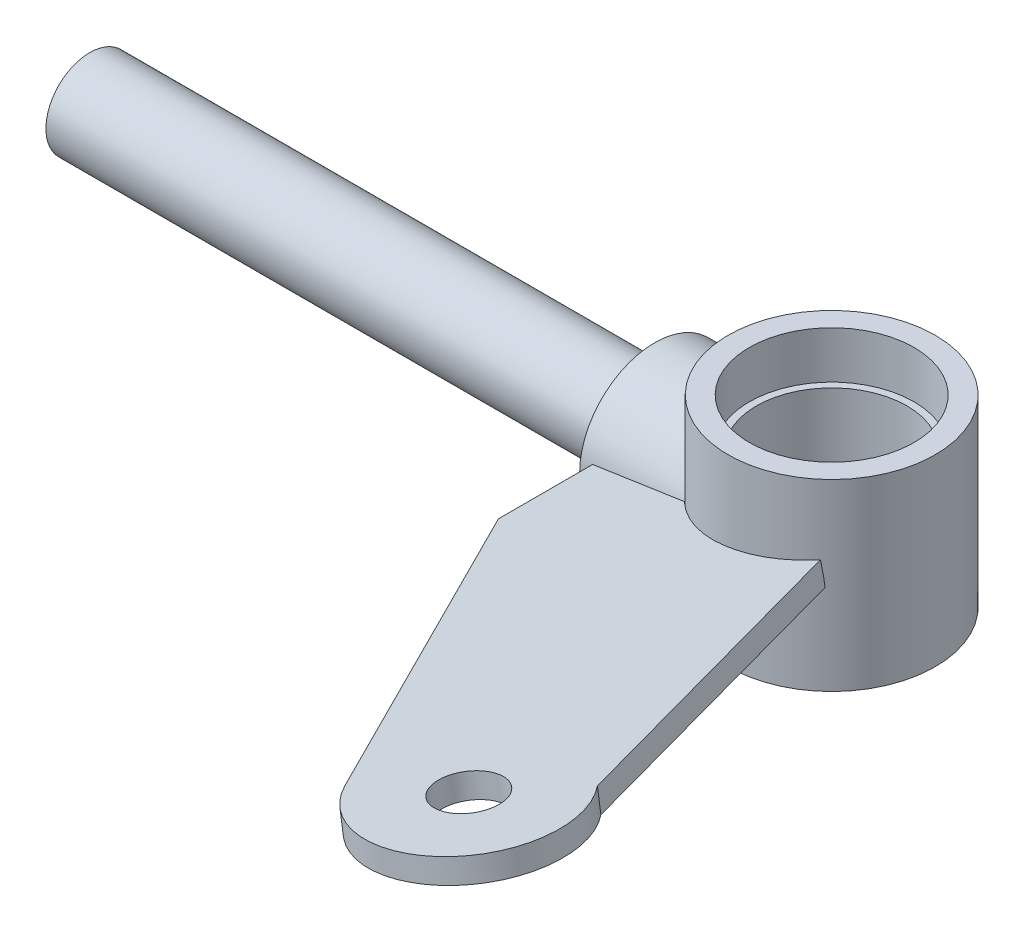
ISO-10303-21;
HEADER;
FILE_DESCRIPTION(('STEP AP214'),'2;1');
FILE_NAME('part.step','',(''),(''),'','','');
FILE_SCHEMA(('AUTOMOTIVE_DESIGN { 1 0 10303 214 1 1 1 1 }'));
ENDSEC;
DATA;
#1=APPLICATION_CONTEXT('core data for automotive mechanical design processes');
#2=APPLICATION_PROTOCOL_DEFINITION('international standard','automotive_design',2000,#1);
#3=PRODUCT_CONTEXT('',#1,'mechanical');
#4=PRODUCT('Part','Part','',(#3));
#5=PRODUCT_RELATED_PRODUCT_CATEGORY('part','',(#4));
#6=PRODUCT_DEFINITION_FORMATION('','',#4);
#7=PRODUCT_DEFINITION_CONTEXT('part definition',#1,'design');
#8=PRODUCT_DEFINITION('design','',#6,#7);
#9=PRODUCT_DEFINITION_SHAPE('','',#8);
#10=(LENGTH_UNIT() NAMED_UNIT(*) SI_UNIT(.MILLI.,.METRE.));
#11=(NAMED_UNIT(*) PLANE_ANGLE_UNIT() SI_UNIT($,.RADIAN.));
#12=(NAMED_UNIT(*) SI_UNIT($,.STERADIAN.) SOLID_ANGLE_UNIT());
#13=UNCERTAINTY_MEASURE_WITH_UNIT(LENGTH_MEASURE(1.E-05),#10,'distance_accuracy_value','');
#14=(GEOMETRIC_REPRESENTATION_CONTEXT(3) GLOBAL_UNCERTAINTY_ASSIGNED_CONTEXT((#13)) GLOBAL_UNIT_ASSIGNED_CONTEXT((#10,
#11,#12)) REPRESENTATION_CONTEXT('',''));
#15=CARTESIAN_POINT('',(0.,0.,0.));
#16=DIRECTION('',(0.,0.,1.));
#17=DIRECTION('',(1.,0.,0.));
#18=AXIS2_PLACEMENT_3D('',#15,#16,#17);
#19=CARTESIAN_POINT('',(-23.8649527829231,-3.56664109055751,0.));
#20=DIRECTION('',(1.,0.,0.));
#21=DIRECTION('',(0.,0.,-1.));
#22=AXIS2_PLACEMENT_3D('',#19,#20,#21);
#23=CYLINDRICAL_SURFACE('',#22,10.1308937353786);
#24=CARTESIAN_POINT('',(-23.8649527829231,-3.56664109055751,0.));
#25=DIRECTION('',(-1.,0.,0.));
#26=DIRECTION('',(0.,0.,1.));
#27=AXIS2_PLACEMENT_3D('',#24,#25,#26);
#28=CIRCLE('',#27,10.1308937353786);
#29=CARTESIAN_POINT('',(-23.8649527829231,-3.56664109055751,10.1308937353786));
#30=VERTEX_POINT('',#29);
#31=EDGE_CURVE('E58',#30,#30,#28,.T.);
#32=ORIENTED_EDGE('',*,*,#31,.F.);
#33=EDGE_LOOP('',(#32));
#34=FACE_BOUND('',#33,.T.);
#35=CARTESIAN_POINT('',(-9.61903800400362,-3.56664109055751,10.1308937353786));
#36=CARTESIAN_POINT('',(-9.61904039518556,-3.80639849007304,10.1308925484275));
#37=CARTESIAN_POINT('',(-9.62804826640795,-4.04617130452357,10.1223617673847));
#38=CARTESIAN_POINT('',(-9.66356299897845,-4.52332005065299,10.088460451511));
#39=CARTESIAN_POINT('',(-9.69007987684676,-4.76069453133077,10.0630802774652));
#40=CARTESIAN_POINT('',(-9.75923055949351,-5.23127763039902,9.99603045747903));
#41=CARTESIAN_POINT('',(-9.8019015506235,-5.46447532682341,9.95432321945606));
#42=CARTESIAN_POINT('',(-9.90128180737341,-5.92461065115534,9.85547651706718));
#43=CARTESIAN_POINT('',(-9.95799916585496,-6.15154458610549,9.79832815451211));
#44=CARTESIAN_POINT('',(-10.0822680357526,-6.59500296099345,9.67039785709462));
#45=CARTESIAN_POINT('',(-10.1496678308784,-6.81162484133087,9.59980439757005));
#46=CARTESIAN_POINT('',(-10.2935220507789,-7.23689009378552,9.44539414340223));
#47=CARTESIAN_POINT('',(-10.3699756105002,-7.4455342256309,9.36157861182483));
#48=CARTESIAN_POINT('',(-10.6096718629706,-8.05899105580503,9.09139352136984));
#49=CARTESIAN_POINT('',(-10.7833486402566,-8.45165774662793,8.8861885255637));
#50=CARTESIAN_POINT('',(-11.0707297974541,-9.05057278524142,8.52232525593784));
#51=CARTESIAN_POINT('',(-11.1803271124111,-9.26806242968694,8.37833864467592));
#52=CARTESIAN_POINT('',(-11.4016441573872,-9.6906947076907,8.07456910940664));
#53=CARTESIAN_POINT('',(-11.5133640558991,-9.89583635561965,7.91478492710445));
#54=CARTESIAN_POINT('',(-11.7367057479711,-10.2935623005356,7.5796609888092));
#55=CARTESIAN_POINT('',(-11.8483272309982,-10.4861301228153,7.40430150800249));
#56=CARTESIAN_POINT('',(-12.0692087650288,-10.8578860164378,7.03851926498492));
#57=CARTESIAN_POINT('',(-12.1784686367169,-11.0370730743084,6.84809536402509));
#58=CARTESIAN_POINT('',(-12.4124255960368,-11.4131649892626,6.41588768798282));
#59=CARTESIAN_POINT('',(-12.5362378994176,-11.6072125319033,6.17112054980703));
#60=CARTESIAN_POINT('',(-12.7744549755405,-11.9737930574009,5.6615641072247));
#61=CARTESIAN_POINT('',(-12.8888578281117,-12.1463216526137,5.39677073715651));
#62=CARTESIAN_POINT('',(-13.1048393114109,-12.4674846211503,4.84877997013028));
#63=CARTESIAN_POINT('',(-13.2064401679256,-12.6161605317473,4.5656157993196));
#64=CARTESIAN_POINT('',(-13.3939004205756,-12.8876020711898,3.98221905452536));
#65=CARTESIAN_POINT('',(-13.4797673764695,-13.0103801476271,3.68199476884057));
#66=CARTESIAN_POINT('',(-13.6110115594488,-13.1966336019867,3.15477503796826));
#67=CARTESIAN_POINT('',(-13.6609505125659,-13.2670334245227,2.93133323530667));
#68=CARTESIAN_POINT('',(-13.7503758553478,-13.392570600585,2.47817568608819));
#69=CARTESIAN_POINT('',(-13.7898645953643,-13.4477113861407,2.24846136312407));
#70=CARTESIAN_POINT('',(-13.8575683254481,-13.5419798008082,1.78428620306748));
#71=CARTESIAN_POINT('',(-13.885790634778,-13.581117826552,1.54982855186427));
#72=CARTESIAN_POINT('',(-13.9303943769411,-13.6428731553088,1.0776134348273));
#73=CARTESIAN_POINT('',(-13.9467753963032,-13.6654898814359,0.83985585406291));
#74=CARTESIAN_POINT('',(-13.9673520552707,-13.6938878916493,0.362262652436662));
#75=CARTESIAN_POINT('',(-13.9715198427555,-13.6996306950487,0.122423530875538));
#76=CARTESIAN_POINT('',(-13.9674958248509,-13.6940815897164,-0.356951834590658));
#77=CARTESIAN_POINT('',(-13.9593040668533,-13.682789746303,-0.596488079653567));
#78=CARTESIAN_POINT('',(-13.9307443343899,-13.6433434302408,-1.0734820401737));
#79=CARTESIAN_POINT('',(-13.9103736947184,-13.6151852665927,-1.31093928912264));
#80=CARTESIAN_POINT('',(-13.8579058877799,-13.5424266781346,-1.78199605263438));
#81=CARTESIAN_POINT('',(-13.8258087529768,-13.4978262988436,-2.01559557787515));
#82=CARTESIAN_POINT('',(-13.7516546264907,-13.3943252629383,-2.47073456285516));
#83=CARTESIAN_POINT('',(-13.7099106900111,-13.3358728600535,-2.69242764401209));
#84=CARTESIAN_POINT('',(-13.6167803089116,-13.2047397005971,-3.12956162592222));
#85=CARTESIAN_POINT('',(-13.5653904956596,-13.132053972933,-3.34500031200948));
#86=CARTESIAN_POINT('',(-13.4539013909604,-12.9732751607129,-3.76847042647945));
#87=CARTESIAN_POINT('',(-13.3938044220822,-12.8871856510606,-3.97650381179523));
#88=CARTESIAN_POINT('',(-13.2658556463471,-12.702366642786,-4.38448447000792));
#89=CARTESIAN_POINT('',(-13.1980010299463,-12.6036325631847,-4.58442877760948));
#90=CARTESIAN_POINT('',(-13.0477251760939,-12.3827907472346,-4.99711503805583));
#91=CARTESIAN_POINT('',(-12.9645227706009,-12.2593060849262,-5.20883565069022));
#92=CARTESIAN_POINT('',(-12.7912655651893,-11.9987261472283,-5.62089044097815));
#93=CARTESIAN_POINT('',(-12.7012078641698,-11.861625101942,-5.82121973456842));
#94=CARTESIAN_POINT('',(-12.5156831813874,-11.5746637198013,-6.21007304769013));
#95=CARTESIAN_POINT('',(-12.4202129330681,-11.4247956498306,-6.39858979053965));
#96=CARTESIAN_POINT('',(-12.2254037176577,-11.1131238721971,-6.76336978651223));
#97=CARTESIAN_POINT('',(-12.1260643094612,-10.9513188017592,-6.93963163609262));
#98=CARTESIAN_POINT('',(-11.9060924564752,-10.5847977195688,-7.31169885898195));
#99=CARTESIAN_POINT('',(-11.784977050915,-10.3777434401458,-7.50492223431334));
#100=CARTESIAN_POINT('',(-11.5421499086569,-9.94838845974052,-7.87326842070626));
#101=CARTESIAN_POINT('',(-11.4204380574974,-9.72608471665142,-8.04838760260167));
#102=CARTESIAN_POINT('',(-11.1793564225601,-9.26667224415712,-8.38002952893089));
#103=CARTESIAN_POINT('',(-11.059987157159,-9.02956028541537,-8.53654819525791));
#104=CARTESIAN_POINT('',(-10.8270403738253,-8.54107815226735,-8.83013329096768));
#105=CARTESIAN_POINT('',(-10.7134613267578,-8.28971177973054,-8.96720487334647));
#106=CARTESIAN_POINT('',(-10.4345578564576,-7.62721997990816,-9.29241023498748));
#107=CARTESIAN_POINT('',(-10.276013055899,-7.20568192841436,-9.46596501358648));
#108=CARTESIAN_POINT('',(-10.0690586595743,-6.55040855821285,-9.68427081004709));
#109=CARTESIAN_POINT('',(-10.0052475501124,-6.32830056588317,-9.7500073736609));
#110=CARTESIAN_POINT('',(-9.89019913814885,-5.87698619457917,-9.86668962366791));
#111=CARTESIAN_POINT('',(-9.83895932371261,-5.64778124400931,-9.91763826528416));
#112=CARTESIAN_POINT('',(-9.75837597016585,-5.22091458018934,-9.99688268890805));
#113=CARTESIAN_POINT('',(-9.72683786447325,-5.0240958262901,-10.0275019956832));
#114=CARTESIAN_POINT('',(-9.67536667327016,-4.62751365762141,-10.077175547512));
#115=CARTESIAN_POINT('',(-9.65543122849678,-4.42775084996649,-10.0962321437387));
#116=CARTESIAN_POINT('',(-9.62795797837324,-4.02671672226621,-10.1224349906279));
#117=CARTESIAN_POINT('',(-9.6204122799653,-3.82544644474953,-10.1295888241474));
#118=CARTESIAN_POINT('',(-9.61800696449502,-3.42275529878834,-10.1318727471276));
#119=CARTESIAN_POINT('',(-9.62314764588194,-3.2213344269125,-10.1270025537211));
#120=CARTESIAN_POINT('',(-9.64588409227045,-2.82015303979755,-10.1053481719863));
#121=CARTESIAN_POINT('',(-9.66346131474361,-2.62039050009428,-10.0885817205352));
#122=CARTESIAN_POINT('',(-9.7103475014837,-2.22359057700764,-10.0434606985891));
#123=CARTESIAN_POINT('',(-9.73965643283577,-2.02655318598011,-10.0151061606061));
#124=CARTESIAN_POINT('',(-9.80896813642319,-1.6361160617716,-9.94723031172033));
#125=CARTESIAN_POINT('',(-9.84898244301011,-1.44272049442085,-9.90769695372883));
#126=CARTESIAN_POINT('',(-9.93840382129691,-1.06054152358299,-9.81799555196965));
#127=CARTESIAN_POINT('',(-9.987816225101,-0.871760807328803,-9.76782146921264));
#128=CARTESIAN_POINT('',(-10.116329852951,-0.423853421042503,-9.63495869026011));
#129=CARTESIAN_POINT('',(-10.1993379012841,-0.167299199204759,-9.54734104960247));
#130=CARTESIAN_POINT('',(-10.3772942193556,0.334306117510249,-9.35360629636579));
#131=CARTESIAN_POINT('',(-10.4722424118898,0.5793572867514,-9.24748930340058));
#132=CARTESIAN_POINT('',(-10.6707826742691,1.05799001089977,-9.01767125631354));
#133=CARTESIAN_POINT('',(-10.7743900143872,1.2915500983756,-8.89393885548554));
#134=CARTESIAN_POINT('',(-10.9870097338924,1.74644839226086,-8.6299043590512));
#135=CARTESIAN_POINT('',(-11.0960215550136,1.96778785605096,-8.48960397280577));
#136=CARTESIAN_POINT('',(-11.3200061370829,2.40435294955986,-8.18868526639421));
#137=CARTESIAN_POINT('',(-11.4350599663479,2.61920935204989,-8.02759203023276));
#138=CARTESIAN_POINT('',(-11.6654520160729,3.03539669583716,-7.68895804136308));
#139=CARTESIAN_POINT('',(-11.7807902494431,3.23672701096218,-7.51141652810762));
#140=CARTESIAN_POINT('',(-12.0092582989231,3.62509143227999,-7.14044990952776));
#141=CARTESIAN_POINT('',(-12.1223902014477,3.81213958654222,-6.9470408106314));
#142=CARTESIAN_POINT('',(-12.3443764724911,4.17142654750338,-6.54447239318099));
#143=CARTESIAN_POINT('',(-12.4532294070762,4.34366041234396,-6.33530786212548));
#144=CARTESIAN_POINT('',(-12.6592105315339,4.66403356177297,-5.91251250663103));
#145=CARTESIAN_POINT('',(-12.756652573291,4.81294498034245,-5.69962055304822));
#146=CARTESIAN_POINT('',(-12.9438341974239,5.09523556233258,-5.26069786253675));
#147=CARTESIAN_POINT('',(-13.0335775948145,5.2286224306741,-5.03467372741163));
#148=CARTESIAN_POINT('',(-13.203639574756,5.47872307569743,-4.5701185779084));
#149=CARTESIAN_POINT('',(-13.2839569590916,5.59543473306986,-4.33158597904411));
#150=CARTESIAN_POINT('',(-13.4334147586671,5.81081876001885,-3.84310964191962));
#151=CARTESIAN_POINT('',(-13.5025552563403,5.90949126264096,-3.59316598783722));
#152=CARTESIAN_POINT('',(-13.6285500984672,6.0881781687157,-3.08116744840382));
#153=CARTESIAN_POINT('',(-13.685296248588,6.16802871246312,-2.8190283988032));
#154=CARTESIAN_POINT('',(-13.7842662640073,6.30667972615402,-2.28653086208386));
#155=CARTESIAN_POINT('',(-13.8264899456796,6.36547992993113,-2.01617227108185));
#156=CARTESIAN_POINT('',(-13.8951876887182,6.46089325607901,-1.46982675384622));
#157=CARTESIAN_POINT('',(-13.92167543574,6.49752565846372,-1.19384493490776));
#158=CARTESIAN_POINT('',(-13.9581604686139,6.54793547020552,-0.638735201978681));
#159=CARTESIAN_POINT('',(-13.9681603176359,6.56171643199589,-0.359607783789694));
#160=CARTESIAN_POINT('',(-13.9711500360893,6.56583795252878,0.159413192084087));
#161=CARTESIAN_POINT('',(-13.9663437645275,6.55921549763676,0.399277514995647));
#162=CARTESIAN_POINT('',(-13.9444750988441,6.52903147048661,0.877354922388121));
#163=CARTESIAN_POINT('',(-13.9274140752457,6.50547179242046,1.11556818850916));
#164=CARTESIAN_POINT('',(-13.8814170008217,6.44177184925209,1.58859789337555));
#165=CARTESIAN_POINT('',(-13.8524806813183,6.40163120900632,1.82341425514167));
#166=CARTESIAN_POINT('',(-13.7833558826398,6.30534603610142,2.28804988925621));
#167=CARTESIAN_POINT('',(-13.7431670481229,6.24920099804036,2.51786900355014));
#168=CARTESIAN_POINT('',(-13.653222476376,6.12286458200034,2.96678777092026));
#169=CARTESIAN_POINT('',(-13.6036632807597,6.05296073537101,3.18600817588901));
#170=CARTESIAN_POINT('',(-13.4953977759985,5.89923694826681,3.61726235028896));
#171=CARTESIAN_POINT('',(-13.4366882895127,5.81541217323288,3.82929359210396));
#172=CARTESIAN_POINT('',(-13.3111546937625,5.63472663802529,4.24514110928424));
#173=CARTESIAN_POINT('',(-13.2443330727005,5.53786987411879,4.44895987820896));
#174=CARTESIAN_POINT('',(-13.1035931875214,5.33189351278721,4.84783428956793));
#175=CARTESIAN_POINT('',(-13.0296723876691,5.22276953127871,5.0428867640026));
#176=CARTESIAN_POINT('',(-12.8655887953336,4.97776246672566,5.44900506020993));
#177=CARTESIAN_POINT('',(-12.774573934779,4.84025107136051,5.65874481038786));
#178=CARTESIAN_POINT('',(-12.5864152819499,4.55148431377991,6.06575202179333));
#179=CARTESIAN_POINT('',(-12.4892688484989,4.40022301627013,6.26301403396537));
#180=CARTESIAN_POINT('',(-12.2903857682433,4.08468018068767,6.64482533350065));
#181=CARTESIAN_POINT('',(-12.1886436622751,3.92038297231731,6.82935880653214));
#182=CARTESIAN_POINT('',(-11.9823876861637,3.57969358465794,7.18509243328137));
#183=CARTESIAN_POINT('',(-11.8778745980929,3.40330479623322,7.35629629651572));
#184=CARTESIAN_POINT('',(-11.647935575154,3.00449779613303,7.71623517005945));
#185=CARTESIAN_POINT('',(-11.5222871992665,2.77967722820198,7.90217618090308));
#186=CARTESIAN_POINT('',(-11.2726129564929,2.31421952225714,8.25443630149153));
#187=CARTESIAN_POINT('',(-11.1485875112876,2.07357836777106,8.42075039824053));
#188=CARTESIAN_POINT('',(-10.9057722570196,1.57697996999549,8.73293186636326));
#189=CARTESIAN_POINT('',(-10.7869801360365,1.32102961008681,8.87880832982476));
#190=CARTESIAN_POINT('',(-10.5587418575411,0.794270740970725,9.14905212486612));
#191=CARTESIAN_POINT('',(-10.4492914539145,0.523469075096433,9.27342925523371));
#192=CARTESIAN_POINT('',(-10.2020195511406,-0.147807927528755,9.54599963851673));
#193=CARTESIAN_POINT('',(-10.0711059209067,-0.555714314304154,9.68286968729264));
#194=CARTESIAN_POINT('',(-9.90733587456377,-1.18537456282063,9.84945002462021));
#195=CARTESIAN_POINT('',(-9.85821569931913,-1.39798272775063,9.89848970747908));
#196=CARTESIAN_POINT('',(-9.77257407853592,-1.82833914504426,9.98305180029197));
#197=CARTESIAN_POINT('',(-9.73604673290652,-2.04608493905188,10.0185805413043));
#198=CARTESIAN_POINT('',(-9.67788393172438,-2.48006028989114,10.0747739941289));
#199=CARTESIAN_POINT('',(-9.65591215394802,-2.69620084434266,10.0957749346338));
#200=CARTESIAN_POINT('',(-9.62648626113937,-3.13043672258906,10.1238371131521));
#201=CARTESIAN_POINT('',(-9.61903582873288,-3.34853252815357,10.1308948151543));
#202=CARTESIAN_POINT('',(-9.61903800400362,-3.56664109055751,10.1308937353786));
#203=B_SPLINE_CURVE_WITH_KNOTS('',3,(#35,#36,#37,#38,#39,#40,#41,#42,#43,#44,#45,#46,#47,#48,
#49,#50,#51,#52,#53,#54,#55,#56,#57,#58,#59,#60,#61,#62,#63,#64,#65,#66,#67,#68,#69,#70,#71,#72,
#73,#74,#75,#76,#77,#78,#79,#80,#81,#82,#83,#84,#85,#86,#87,#88,#89,#90,#91,#92,#93,#94,#95,#96,
#97,#98,#99,#100,#101,#102,#103,#104,#105,#106,#107,#108,#109,#110,#111,#112,#113,#114,#115,
#116,#117,#118,#119,#120,#121,#122,#123,#124,#125,#126,#127,#128,#129,#130,#131,#132,#133,#134,
#135,#136,#137,#138,#139,#140,#141,#142,#143,#144,#145,#146,#147,#148,#149,#150,#151,#152,#153,
#154,#155,#156,#157,#158,#159,#160,#161,#162,#163,#164,#165,#166,#167,#168,#169,#170,#171,#172,
#173,#174,#175,#176,#177,#178,#179,#180,#181,#182,#183,#184,#185,#186,#187,#188,#189,#190,#191,
#192,#193,#194,#195,#196,#197,#198,#199,#200,#201,#202),.UNSPECIFIED.,.T.,.F.,(4,2,2,2,2,2,2,2,
2,2,2,2,2,2,2,2,2,2,2,2,2,2,2,2,2,2,2,2,2,2,2,2,2,2,2,2,2,2,2,2,2,2,2,2,2,2,2,2,2,2,2,2,2,2,2,2,
2,2,2,2,2,2,2,2,2,2,2,2,2,2,2,2,2,2,2,2,2,2,2,2,2,2,2,4),(0.,0.718986430556499,1.43838453432068,
2.15944884422623,2.88092956821217,3.59295563755625,4.30491373027604,5.72776731350085,
6.57598137740762,7.42426305706003,8.27363476416962,9.12307073841017,10.1296948523243,
11.1365238792831,12.1415801146481,13.1461521712457,13.8640302461093,14.5817467259189,
15.2989961777896,16.0162706731741,16.7351796358586,17.4540858419387,18.1731494298417,
18.8922110270861,19.5905886992465,20.2892107213434,20.9876467331289,21.6863364996942,
22.4621002275026,23.2381940966427,24.0147614424422,24.7914175818404,25.714522601662,
26.6378123097394,27.5613040742839,28.4845506775028,29.9265069423248,30.6465965896972,
31.3665422348896,31.9709148179918,32.5751644661552,33.1790290192293,33.782907778455,
34.3858880638182,34.9888666574522,35.5924975564188,36.1964719585592,37.0457694927818,
37.8950615357868,38.7458842406101,39.5966192404727,40.4722840821963,41.3479894337663,
42.2228220302062,43.0979453368963,43.9295666705423,44.7607734897943,45.5920858561592,
46.4233920910355,47.2616882272785,48.0999949627971,48.9375715455123,49.7750179082545,
50.4941329360237,51.213167553324,51.9322184396432,52.6512920353434,53.3566862334085,
54.0623259200509,54.7677497129391,55.4734264179514,56.2730674837934,57.0730553775135,
57.8740199357032,58.6747607895957,59.6267026398152,60.5788871058234,61.5306466193494,
62.4819711974511,63.8255216151532,64.4958132474092,65.1657904012277,65.8196903157807,
66.4737560383548),.UNSPECIFIED.);
#204=CARTESIAN_POINT('',(-9.61903800400362,-3.56664109055751,10.1308937353786));
#205=VERTEX_POINT('',#204);
#206=EDGE_CURVE('E66',#205,#205,#203,.T.);
#207=ORIENTED_EDGE('',*,*,#206,.F.);
#208=EDGE_LOOP('',(#207));
#209=FACE_BOUND('',#208,.T.);
#210=ADVANCED_FACE('F55',(#34,#209),#23,.T.);
#211=CARTESIAN_POINT('',(-23.8649527829231,-3.56664109055751,0.));
#212=DIRECTION('',(-1.,0.,0.));
#213=DIRECTION('',(0.,0.,1.));
#214=AXIS2_PLACEMENT_3D('',#211,#212,#213);
#215=PLANE('',#214);
#216=CARTESIAN_POINT('',(-23.8649527829231,-3.56664109055751,0.));
#217=DIRECTION('',(-1.,0.,0.));
#218=DIRECTION('',(0.,0.,1.));
#219=AXIS2_PLACEMENT_3D('',#216,#217,#218);
#220=CIRCLE('',#219,5.92106637307848);
#221=CARTESIAN_POINT('',(-23.8649527829231,-3.56664109055751,-5.92106637307848));
#222=VERTEX_POINT('',#221);
#223=EDGE_CURVE('E13',#222,#222,#220,.T.);
#224=ORIENTED_EDGE('',*,*,#223,.F.);
#225=EDGE_LOOP('',(#224));
#226=FACE_BOUND('',#225,.T.);
#227=ORIENTED_EDGE('',*,*,#31,.T.);
#228=EDGE_LOOP('',(#227));
#229=FACE_BOUND('',#228,.T.);
#230=ADVANCED_FACE('F81',(#226,#229),#215,.T.);
#231=CARTESIAN_POINT('',(0.,-12.3825,0.));
#232=DIRECTION('',(0.,-1.,0.));
#233=DIRECTION('',(0.,0.,-1.));
#234=AXIS2_PLACEMENT_3D('',#231,#232,#233);
#235=CYLINDRICAL_SURFACE('',#234,13.97);
#236=ORIENTED_EDGE('',*,*,#206,.T.);
#237=EDGE_LOOP('',(#236));
#238=FACE_BOUND('',#237,.T.);
#239=ADVANCED_FACE('F77',(#238),#235,.F.);
#240=CARTESIAN_POINT('',(-100.064952782923,-3.56664109055751,0.));
#241=DIRECTION('',(1.,0.,0.));
#242=DIRECTION('',(0.,0.,-1.));
#243=AXIS2_PLACEMENT_3D('',#240,#241,#242);
#244=CYLINDRICAL_SURFACE('',#243,5.92106637307848);
#245=CARTESIAN_POINT('',(-100.064952782923,-3.56664109055751,0.));
#246=DIRECTION('',(-1.,0.,0.));
#247=DIRECTION('',(0.,0.,1.));
#248=AXIS2_PLACEMENT_3D('',#245,#246,#247);
#249=CIRCLE('',#248,5.92106637307848);
#250=CARTESIAN_POINT('',(-100.064952782923,-3.56664109055751,-5.92106637307847));
#251=VERTEX_POINT('',#250);
#252=EDGE_CURVE('E68',#251,#251,#249,.T.);
#253=CARTESIAN_POINT('',(-100.064952782923,-3.56664109055751,-5.92106637307847));
#254=CARTESIAN_POINT('',(-99.2712027829231,-3.56664109055751,-5.92106637307847));
#255=CARTESIAN_POINT('',(-98.4774527829231,-3.56664109055751,-5.92106637307847));
#256=CARTESIAN_POINT('',(-96.8899527829231,-3.56664109055751,-5.92106637307847));
#257=CARTESIAN_POINT('',(-96.0962027829231,-3.56664109055751,-5.92106637307847));
#258=CARTESIAN_POINT('',(-94.5087027829231,-3.56664109055751,-5.92106637307847));
#259=CARTESIAN_POINT('',(-93.7149527829231,-3.56664109055751,-5.92106637307847));
#260=CARTESIAN_POINT('',(-92.1274527829231,-3.56664109055751,-5.92106637307847));
#261=CARTESIAN_POINT('',(-91.3337027829231,-3.56664109055751,-5.92106637307848));
#262=CARTESIAN_POINT('',(-89.7462027829231,-3.56664109055751,-5.92106637307848));
#263=CARTESIAN_POINT('',(-88.9524527829231,-3.56664109055751,-5.92106637307848));
#264=CARTESIAN_POINT('',(-87.3649527829231,-3.56664109055751,-5.92106637307848));
#265=CARTESIAN_POINT('',(-86.5712027829231,-3.56664109055751,-5.92106637307848));
#266=CARTESIAN_POINT('',(-84.9837027829231,-3.56664109055751,-5.92106637307848));
#267=CARTESIAN_POINT('',(-84.1899527829231,-3.56664109055751,-5.92106637307848));
#268=CARTESIAN_POINT('',(-82.6024527829231,-3.56664109055751,-5.92106637307848));
#269=CARTESIAN_POINT('',(-81.8087027829231,-3.56664109055751,-5.92106637307848));
#270=CARTESIAN_POINT('',(-80.2212027829231,-3.56664109055751,-5.92106637307848));
#271=CARTESIAN_POINT('',(-79.4274527829231,-3.56664109055751,-5.92106637307848));
#272=CARTESIAN_POINT('',(-77.8399527829231,-3.56664109055751,-5.92106637307848));
#273=CARTESIAN_POINT('',(-77.0462027829231,-3.56664109055751,-5.92106637307848));
#274=CARTESIAN_POINT('',(-75.4587027829231,-3.56664109055751,-5.92106637307848));
#275=CARTESIAN_POINT('',(-74.6649527829231,-3.56664109055751,-5.92106637307848));
#276=CARTESIAN_POINT('',(-73.0774527829231,-3.56664109055751,-5.92106637307848));
#277=CARTESIAN_POINT('',(-72.2837027829231,-3.56664109055751,-5.92106637307848));
#278=CARTESIAN_POINT('',(-70.6962027829231,-3.56664109055751,-5.92106637307848));
#279=CARTESIAN_POINT('',(-69.902452782923,-3.56664109055751,-5.92106637307848));
#280=CARTESIAN_POINT('',(-68.3149527829231,-3.56664109055751,-5.92106637307848));
#281=CARTESIAN_POINT('',(-67.5212027829231,-3.56664109055751,-5.92106637307848));
#282=CARTESIAN_POINT('',(-65.9337027829231,-3.56664109055751,-5.92106637307848));
#283=CARTESIAN_POINT('',(-65.1399527829231,-3.56664109055751,-5.92106637307848));
#284=CARTESIAN_POINT('',(-63.5524527829231,-3.56664109055751,-5.92106637307848));
#285=CARTESIAN_POINT('',(-62.7587027829231,-3.56664109055751,-5.92106637307848));
#286=CARTESIAN_POINT('',(-61.1712027829231,-3.56664109055751,-5.92106637307848));
#287=CARTESIAN_POINT('',(-60.3774527829231,-3.56664109055751,-5.92106637307848));
#288=CARTESIAN_POINT('',(-58.7899527829231,-3.56664109055751,-5.92106637307848));
#289=CARTESIAN_POINT('',(-57.9962027829231,-3.56664109055751,-5.92106637307848));
#290=CARTESIAN_POINT('',(-56.4087027829231,-3.56664109055751,-5.92106637307848));
#291=CARTESIAN_POINT('',(-55.6149527829231,-3.56664109055751,-5.92106637307848));
#292=CARTESIAN_POINT('',(-54.0274527829231,-3.56664109055751,-5.92106637307848));
#293=CARTESIAN_POINT('',(-53.2337027829231,-3.56664109055751,-5.92106637307848));
#294=CARTESIAN_POINT('',(-51.6462027829231,-3.56664109055751,-5.92106637307848));
#295=CARTESIAN_POINT('',(-50.8524527829231,-3.56664109055751,-5.92106637307848));
#296=CARTESIAN_POINT('',(-49.2649527829231,-3.56664109055751,-5.92106637307848));
#297=CARTESIAN_POINT('',(-48.4712027829231,-3.56664109055751,-5.92106637307848));
#298=CARTESIAN_POINT('',(-46.8837027829231,-3.56664109055751,-5.92106637307848));
#299=CARTESIAN_POINT('',(-46.0899527829231,-3.56664109055751,-5.92106637307848));
#300=CARTESIAN_POINT('',(-44.5024527829231,-3.56664109055751,-5.92106637307848));
#301=CARTESIAN_POINT('',(-43.7087027829231,-3.56664109055751,-5.92106637307848));
#302=CARTESIAN_POINT('',(-42.1212027829231,-3.56664109055751,-5.92106637307848));
#303=CARTESIAN_POINT('',(-41.3274527829231,-3.56664109055751,-5.92106637307848));
#304=CARTESIAN_POINT('',(-39.7399527829231,-3.56664109055751,-5.92106637307848));
#305=CARTESIAN_POINT('',(-38.9462027829231,-3.56664109055751,-5.92106637307848));
#306=CARTESIAN_POINT('',(-37.3587027829231,-3.56664109055751,-5.92106637307848));
#307=CARTESIAN_POINT('',(-36.5649527829231,-3.56664109055751,-5.92106637307848));
#308=CARTESIAN_POINT('',(-34.9774527829231,-3.56664109055751,-5.92106637307848));
#309=CARTESIAN_POINT('',(-34.1837027829231,-3.56664109055751,-5.92106637307848));
#310=CARTESIAN_POINT('',(-32.5962027829231,-3.56664109055751,-5.92106637307848));
#311=CARTESIAN_POINT('',(-31.8024527829231,-3.56664109055751,-5.92106637307848));
#312=CARTESIAN_POINT('',(-30.2149527829231,-3.56664109055751,-5.92106637307848));
#313=CARTESIAN_POINT('',(-29.4212027829231,-3.56664109055751,-5.92106637307848));
#314=CARTESIAN_POINT('',(-27.8337027829231,-3.56664109055751,-5.92106637307848));
#315=CARTESIAN_POINT('',(-27.0399527829231,-3.56664109055751,-5.92106637307848));
#316=CARTESIAN_POINT('',(-25.4524527829231,-3.56664109055751,-5.92106637307848));
#317=CARTESIAN_POINT('',(-24.6587027829231,-3.56664109055751,-5.92106637307848));
#318=CARTESIAN_POINT('',(-23.8649527829231,-3.56664109055751,-5.92106637307848));
#319=B_SPLINE_CURVE_WITH_KNOTS('',3,(#253,#254,#255,#256,#257,#258,#259,#260,#261,#262,#263,
#264,#265,#266,#267,#268,#269,#270,#271,#272,#273,#274,#275,#276,#277,#278,#279,#280,#281,#282,
#283,#284,#285,#286,#287,#288,#289,#290,#291,#292,#293,#294,#295,#296,#297,#298,#299,#300,#301,
#302,#303,#304,#305,#306,#307,#308,#309,#310,#311,#312,#313,#314,#315,#316,#317,#318),
.UNSPECIFIED.,.F.,.F.,(4,2,2,2,2,2,2,2,2,2,2,2,2,2,2,2,2,2,2,2,2,2,2,2,2,2,2,2,2,2,2,2,4),(0.,
2.38124999999999,4.76249999999999,7.14374999999999,9.52499999999999,11.90625,14.2875,16.66875,
19.05,21.43125,23.8125,26.19375,28.575,30.95625,33.3375,35.71875,38.1,40.48125,42.8625,45.24375,
47.625,50.00625,52.3875,54.76875,57.15,59.53125,61.9125,64.29375,66.675,69.05625,71.4375,
73.81875,76.2),.UNSPECIFIED.);
#320=EDGE_CURVE('BSEAM80',#251,#222,#319,.T.);
#321=ORIENTED_EDGE('',*,*,#252,.F.);
#322=ORIENTED_EDGE('',*,*,#223,.T.);
#323=ORIENTED_EDGE('',*,*,#320,.T.);
#324=ORIENTED_EDGE('',*,*,#320,.F.);
#325=EDGE_LOOP('',(#321,#323,#322,#324));
#326=FACE_BOUND('',#325,.T.);
#327=ADVANCED_FACE('F80',(#326),#244,.T.);
#328=CARTESIAN_POINT('',(-100.064952782923,-3.56664109055751,0.));
#329=DIRECTION('',(-1.,0.,0.));
#330=DIRECTION('',(0.,0.,1.));
#331=AXIS2_PLACEMENT_3D('',#328,#329,#330);
#332=PLANE('',#331);
#333=ORIENTED_EDGE('',*,*,#252,.T.);
#334=EDGE_LOOP('',(#333));
#335=FACE_BOUND('',#334,.T.);
#336=ADVANCED_FACE('F115',(#335),#332,.T.);
#337=CLOSED_SHELL('',(#210,#230,#239,#327,#336));
#338=MANIFOLD_SOLID_BREP('B2',#337);
#339=CARTESIAN_POINT('',(0.234647440168257,-1.57006268308705,0.));
#340=DIRECTION('',(-0.147809411129611,0.989015863361917,0.));
#341=DIRECTION('',(-0.989015863361917,-0.147809411129611,0.));
#342=AXIS2_PLACEMENT_3D('',#339,#340,#341);
#343=CYLINDRICAL_SURFACE('',#342,13.97);
#344=DIRECTION('',(-0.147809411129611,0.989015863361917,0.));
#345=VECTOR('',#344,1.);
#346=CARTESIAN_POINT('',(-9.24832320807506,-2.9873021422314,10.16));
#347=LINE('',#346,#345);
#348=CARTESIAN_POINT('',(-9.24832320807506,-2.9873021422314,10.16));
#349=VERTEX_POINT('',#348);
#350=CARTESIAN_POINT('',(-9.71761808841157,0.152823223942687,10.16));
#351=VERTEX_POINT('',#350);
#352=EDGE_CURVE('E144',#349,#351,#347,.T.);
#353=ORIENTED_EDGE('',*,*,#352,.T.);
#354=CARTESIAN_POINT('',(-0.234647440168257,1.57006268308704,0.));
#355=DIRECTION('',(-0.147809411129611,0.989015863361917,0.));
#356=DIRECTION('',(-0.989015863361917,-0.147809411129611,0.));
#357=AXIS2_PLACEMENT_3D('',#354,#355,#356);
#358=CIRCLE('',#357,13.97);
#359=CARTESIAN_POINT('',(9.00909998125439,2.95154999143708,10.382944015346));
#360=VERTEX_POINT('',#359);
#361=EDGE_CURVE('E195',#351,#360,#358,.T.);
#362=ORIENTED_EDGE('',*,*,#361,.T.);
#363=DIRECTION('',(-0.147809411129611,0.989015863361917,0.));
#364=VECTOR('',#363,1.);
#365=CARTESIAN_POINT('',(9.47839486159091,-0.188575374737006,10.382944015346));
#366=LINE('',#365,#364);
#367=CARTESIAN_POINT('',(9.47839486159091,-0.188575374737006,10.382944015346));
#368=VERTEX_POINT('',#367);
#369=EDGE_CURVE('E53',#368,#360,#366,.T.);
#370=ORIENTED_EDGE('',*,*,#369,.F.);
#371=CARTESIAN_POINT('',(0.234647440168257,-1.57006268308705,0.));
#372=DIRECTION('',(-0.147809411129611,0.989015863361917,0.));
#373=DIRECTION('',(-0.989015863361917,-0.147809411129611,0.));
#374=AXIS2_PLACEMENT_3D('',#371,#372,#373);
#375=CIRCLE('',#374,13.97);
#376=EDGE_CURVE('E197',#349,#368,#375,.T.);
#377=ORIENTED_EDGE('',*,*,#376,.F.);
#378=EDGE_LOOP('',(#353,#362,#370,#377));
#379=FACE_BOUND('',#378,.T.);
#380=ADVANCED_FACE('F141',(#379),#343,.F.);
#381=CARTESIAN_POINT('',(5.75075478009399,-0.745674917585867,-1.73476149026003));
#382=DIRECTION('',(-0.944388682248357,-0.1411398342248,0.297000949554388));
#383=DIRECTION('',(0.300004089416815,0.,0.953937915345222));
#384=AXIS2_PLACEMENT_3D('',#381,#382,#383);
#385=PLANE('',#384);
#386=ORIENTED_EDGE('',*,*,#369,.T.);
#387=DIRECTION('',(0.293738650542842,0.0438995354585693,0.95487718370678));
#388=VECTOR('',#387,1.);
#389=CARTESIAN_POINT('',(5.28145989975747,2.39445044858822,-1.73476149026003));
#390=LINE('',#389,#388);
#391=CARTESIAN_POINT('',(22.4388310840731,4.95863675260287,54.03992885442));
#392=VERTEX_POINT('',#391);
#393=EDGE_CURVE('E211',#360,#392,#390,.T.);
#394=ORIENTED_EDGE('',*,*,#393,.T.);
#395=DIRECTION('',(-0.147809411129611,0.989015863361917,0.));
#396=VECTOR('',#395,1.);
#397=CARTESIAN_POINT('',(22.9081259644096,1.81851138642878,54.03992885442));
#398=LINE('',#397,#396);
#399=CARTESIAN_POINT('',(22.9081259644096,1.81851138642878,54.03992885442));
#400=VERTEX_POINT('',#399);
#401=EDGE_CURVE('E149',#400,#392,#398,.T.);
#402=ORIENTED_EDGE('',*,*,#401,.F.);
#403=DIRECTION('',(0.293738650542842,0.0438995354585693,0.95487718370678));
#404=VECTOR('',#403,1.);
#405=CARTESIAN_POINT('',(5.75075478009399,-0.745674917585867,-1.73476149026003));
#406=LINE('',#405,#404);
#407=EDGE_CURVE('E156',#368,#400,#406,.T.);
#408=ORIENTED_EDGE('',*,*,#407,.F.);
#409=EDGE_LOOP('',(#386,#394,#402,#408));
#410=FACE_BOUND('',#409,.T.);
#411=ADVANCED_FACE('F259',(#410),#385,.F.);
#412=CARTESIAN_POINT('',(13.5706498734737,0.423016234564858,62.0518224996404));
#413=DIRECTION('',(-0.147809411129611,0.989015863361917,0.));
#414=DIRECTION('',(-0.989015863361917,-0.147809411129611,0.));
#415=AXIS2_PLACEMENT_3D('',#412,#413,#414);
#416=CYLINDRICAL_SURFACE('',#415,12.3825);
#417=ORIENTED_EDGE('',*,*,#401,.T.);
#418=CARTESIAN_POINT('',(13.1013549931372,3.56314160073894,62.0518224996404));
#419=DIRECTION('',(-0.147809411129611,0.989015863361917,0.));
#420=DIRECTION('',(-0.989015863361917,-0.147809411129611,0.));
#421=AXIS2_PLACEMENT_3D('',#418,#419,#420);
#422=CIRCLE('',#421,12.3825);
#423=CARTESIAN_POINT('',(2.36023771189573,1.95787086744899,67.9997474885302));
#424=VERTEX_POINT('',#423);
#425=EDGE_CURVE('E222',#424,#392,#422,.T.);
#426=ORIENTED_EDGE('',*,*,#425,.F.);
#427=DIRECTION('',(-0.147809411129611,0.989015863361917,0.));
#428=VECTOR('',#427,1.);
#429=CARTESIAN_POINT('',(2.82953259223224,-1.1822544987251,67.9997474885302));
#430=LINE('',#429,#428);
#431=CARTESIAN_POINT('',(2.82953259223224,-1.1822544987251,67.9997474885302));
#432=VERTEX_POINT('',#431);
#433=EDGE_CURVE('E244',#432,#424,#430,.T.);
#434=ORIENTED_EDGE('',*,*,#433,.F.);
#435=CARTESIAN_POINT('',(13.5706498734737,0.423016234564858,62.0518224996404));
#436=DIRECTION('',(-0.147809411129611,0.989015863361917,0.));
#437=DIRECTION('',(-0.989015863361917,-0.147809411129611,0.));
#438=AXIS2_PLACEMENT_3D('',#435,#436,#437);
#439=CIRCLE('',#438,12.3825);
#440=EDGE_CURVE('E237',#432,#400,#439,.T.);
#441=ORIENTED_EDGE('',*,*,#440,.T.);
#442=EDGE_LOOP('',(#417,#426,#434,#441));
#443=FACE_BOUND('',#442,.T.);
#444=ADVANCED_FACE('F256',(#443),#416,.T.);
#445=CARTESIAN_POINT('',(-26.1030479065553,-5.50625762588314,14.5845755335089));
#446=DIRECTION('',(-0.867443349989213,-0.12964027726953,0.480349282365418));
#447=DIRECTION('',(0.484437405220755,0.,0.874825925783514));
#448=AXIS2_PLACEMENT_3D('',#445,#446,#447);
#449=PLANE('',#448);
#450=ORIENTED_EDGE('',*,*,#433,.T.);
#451=DIRECTION('',(0.475073060213911,0.0710001445629636,0.877077286749023));
#452=VECTOR('',#451,1.);
#453=CARTESIAN_POINT('',(-26.5723427868918,-2.36613225970906,14.5845755335089));
#454=LINE('',#453,#452);
#455=CARTESIAN_POINT('',(-22.0899199887399,-1.6962296840551,22.86));
#456=VERTEX_POINT('',#455);
#457=EDGE_CURVE('E217',#456,#424,#454,.T.);
#458=ORIENTED_EDGE('',*,*,#457,.F.);
#459=DIRECTION('',(-0.147809411129611,0.989015863361917,0.));
#460=VECTOR('',#459,1.);
#461=CARTESIAN_POINT('',(-21.6206251084034,-4.83635505022919,22.86));
#462=LINE('',#461,#460);
#463=CARTESIAN_POINT('',(-21.6206251084034,-4.83635505022919,22.86));
#464=VERTEX_POINT('',#463);
#465=EDGE_CURVE('E246',#464,#456,#462,.T.);
#466=ORIENTED_EDGE('',*,*,#465,.F.);
#467=DIRECTION('',(0.475073060213911,0.0710001445629636,0.877077286749023));
#468=VECTOR('',#467,1.);
#469=CARTESIAN_POINT('',(-26.1030479065553,-5.50625762588314,14.5845755335089));
#470=LINE('',#469,#468);
#471=EDGE_CURVE('E234',#464,#432,#470,.T.);
#472=ORIENTED_EDGE('',*,*,#471,.T.);
#473=EDGE_LOOP('',(#450,#458,#466,#472));
#474=FACE_BOUND('',#473,.T.);
#475=ADVANCED_FACE('F254',(#474),#449,.T.);
#476=CARTESIAN_POINT('',(-21.6206251084034,-4.83635505022919,0.));
#477=DIRECTION('',(-0.989015863361917,-0.147809411129611,0.));
#478=DIRECTION('',(0.147809411129611,-0.989015863361917,0.));
#479=AXIS2_PLACEMENT_3D('',#476,#477,#478);
#480=PLANE('',#479);
#481=ORIENTED_EDGE('',*,*,#465,.T.);
#482=DIRECTION('',(0.,0.,1.));
#483=VECTOR('',#482,1.);
#484=CARTESIAN_POINT('',(-22.0899199887399,-1.6962296840551,0.));
#485=LINE('',#484,#483);
#486=CARTESIAN_POINT('',(-22.0899199887399,-1.6962296840551,10.16));
#487=VERTEX_POINT('',#486);
#488=EDGE_CURVE('E215',#487,#456,#485,.T.);
#489=ORIENTED_EDGE('',*,*,#488,.F.);
#490=DIRECTION('',(-0.147809411129611,0.989015863361917,0.));
#491=VECTOR('',#490,1.);
#492=CARTESIAN_POINT('',(-21.6206251084034,-4.83635505022919,10.16));
#493=LINE('',#492,#491);
#494=CARTESIAN_POINT('',(-21.6206251084034,-4.83635505022919,10.16));
#495=VERTEX_POINT('',#494);
#496=EDGE_CURVE('E201',#495,#487,#493,.T.);
#497=ORIENTED_EDGE('',*,*,#496,.F.);
#498=DIRECTION('',(0.,0.,1.));
#499=VECTOR('',#498,1.);
#500=CARTESIAN_POINT('',(-21.6206251084034,-4.83635505022919,0.));
#501=LINE('',#500,#499);
#502=EDGE_CURVE('E231',#495,#464,#501,.T.);
#503=ORIENTED_EDGE('',*,*,#502,.T.);
#504=EDGE_LOOP('',(#481,#489,#497,#503));
#505=FACE_BOUND('',#504,.T.);
#506=ADVANCED_FACE('F248',(#505),#480,.T.);
#507=CARTESIAN_POINT('',(0.234647440168259,-1.57006268308704,10.16));
#508=DIRECTION('',(0.,0.,1.));
#509=DIRECTION('',(1.,0.,0.));
#510=AXIS2_PLACEMENT_3D('',#507,#508,#509);
#511=PLANE('',#510);
#512=ORIENTED_EDGE('',*,*,#496,.T.);
#513=DIRECTION('',(0.989015863361917,0.147809411129611,0.));
#514=VECTOR('',#513,1.);
#515=CARTESIAN_POINT('',(-0.234647440168256,1.57006268308704,10.16));
#516=LINE('',#515,#514);
#517=EDGE_CURVE('E208',#487,#351,#516,.T.);
#518=ORIENTED_EDGE('',*,*,#517,.T.);
#519=ORIENTED_EDGE('',*,*,#352,.F.);
#520=DIRECTION('',(0.989015863361917,0.147809411129611,0.));
#521=VECTOR('',#520,1.);
#522=CARTESIAN_POINT('',(0.234647440168259,-1.57006268308704,10.16));
#523=LINE('',#522,#521);
#524=EDGE_CURVE('E229',#495,#349,#523,.T.);
#525=ORIENTED_EDGE('',*,*,#524,.F.);
#526=EDGE_LOOP('',(#512,#518,#519,#525));
#527=FACE_BOUND('',#526,.T.);
#528=ADVANCED_FACE('F213',(#527),#511,.F.);
#529=CARTESIAN_POINT('',(13.5706498734737,0.423016234564858,62.0518224996404));
#530=DIRECTION('',(-0.147809411129611,0.989015863361917,0.));
#531=DIRECTION('',(-0.989015863361917,-0.147809411129611,0.));
#532=AXIS2_PLACEMENT_3D('',#529,#530,#531);
#533=CYLINDRICAL_SURFACE('',#532,4.12750000000001);
#534=CARTESIAN_POINT('',(13.5706498734737,0.423016234564858,62.0518224996404));
#535=DIRECTION('',(-0.147809411129611,0.989015863361917,0.));
#536=DIRECTION('',(-0.989015863361917,-0.147809411129611,0.));
#537=AXIS2_PLACEMENT_3D('',#534,#535,#536);
#538=CIRCLE('',#537,4.12750000000001);
#539=CARTESIAN_POINT('',(9.48848689744735,-0.187067109872612,62.0518224996404));
#540=VERTEX_POINT('',#539);
#541=EDGE_CURVE('E202',#540,#540,#538,.T.);
#542=ORIENTED_EDGE('',*,*,#541,.F.);
#543=EDGE_LOOP('',(#542));
#544=FACE_BOUND('',#543,.T.);
#545=CARTESIAN_POINT('',(13.1013549931372,3.56314160073894,62.0518224996404));
#546=DIRECTION('',(-0.147809411129611,0.989015863361917,0.));
#547=DIRECTION('',(-0.989015863361917,-0.147809411129611,0.));
#548=AXIS2_PLACEMENT_3D('',#545,#546,#547);
#549=CIRCLE('',#548,4.12750000000001);
#550=CARTESIAN_POINT('',(9.01919201711084,2.95305825630147,62.0518224996404));
#551=VERTEX_POINT('',#550);
#552=EDGE_CURVE('E225',#551,#551,#549,.T.);
#553=ORIENTED_EDGE('',*,*,#552,.T.);
#554=EDGE_LOOP('',(#553));
#555=FACE_BOUND('',#554,.T.);
#556=ADVANCED_FACE('F268',(#544,#555),#533,.F.);
#557=CARTESIAN_POINT('',(0.234647440168257,-1.57006268308704,0.));
#558=DIRECTION('',(-0.147809411129611,0.989015863361917,0.));
#559=DIRECTION('',(-0.989015863361917,-0.147809411129611,0.));
#560=AXIS2_PLACEMENT_3D('',#557,#558,#559);
#561=PLANE('',#560);
#562=ORIENTED_EDGE('',*,*,#376,.T.);
#563=ORIENTED_EDGE('',*,*,#407,.T.);
#564=ORIENTED_EDGE('',*,*,#440,.F.);
#565=ORIENTED_EDGE('',*,*,#471,.F.);
#566=ORIENTED_EDGE('',*,*,#502,.F.);
#567=ORIENTED_EDGE('',*,*,#524,.T.);
#568=EDGE_LOOP('',(#562,#563,#564,#565,#566,#567));
#569=FACE_BOUND('',#568,.T.);
#570=ORIENTED_EDGE('',*,*,#541,.T.);
#571=EDGE_LOOP('',(#570));
#572=FACE_BOUND('',#571,.T.);
#573=ADVANCED_FACE('F257',(#569,#572),#561,.F.);
#574=CARTESIAN_POINT('',(-0.234647440168257,1.57006268308704,0.));
#575=DIRECTION('',(-0.147809411129611,0.989015863361917,0.));
#576=DIRECTION('',(-0.989015863361917,-0.147809411129611,0.));
#577=AXIS2_PLACEMENT_3D('',#574,#575,#576);
#578=PLANE('',#577);
#579=ORIENTED_EDGE('',*,*,#361,.F.);
#580=ORIENTED_EDGE('',*,*,#517,.F.);
#581=ORIENTED_EDGE('',*,*,#488,.T.);
#582=ORIENTED_EDGE('',*,*,#457,.T.);
#583=ORIENTED_EDGE('',*,*,#425,.T.);
#584=ORIENTED_EDGE('',*,*,#393,.F.);
#585=EDGE_LOOP('',(#579,#580,#581,#582,#583,#584));
#586=FACE_BOUND('',#585,.T.);
#587=ORIENTED_EDGE('',*,*,#552,.F.);
#588=EDGE_LOOP('',(#587));
#589=FACE_BOUND('',#588,.T.);
#590=ADVANCED_FACE('F205',(#586,#589),#578,.T.);
#591=CLOSED_SHELL('',(#380,#411,#444,#475,#506,#528,#556,#573,#590));
#592=MANIFOLD_SOLID_BREP('B8',#591);
#593=CARTESIAN_POINT('',(13.97,-12.3825,0.));
#594=DIRECTION('',(0.,-1.,0.));
#595=DIRECTION('',(0.,0.,-1.));
#596=AXIS2_PLACEMENT_3D('',#593,#594,#595);
#597=PLANE('',#596);
#598=CARTESIAN_POINT('',(0.,-12.3825,0.));
#599=DIRECTION('',(0.,-1.,0.));
#600=DIRECTION('',(0.,0.,-1.));
#601=AXIS2_PLACEMENT_3D('',#598,#599,#600);
#602=CIRCLE('',#601,13.97);
#603=CARTESIAN_POINT('',(0.,-12.3825,-13.97));
#604=VERTEX_POINT('',#603);
#605=EDGE_CURVE('E365',#604,#604,#602,.T.);
#606=ORIENTED_EDGE('',*,*,#605,.T.);
#607=EDGE_LOOP('',(#606));
#608=FACE_BOUND('',#607,.T.);
#609=CARTESIAN_POINT('',(0.,-12.3825,0.));
#610=DIRECTION('',(0.,-1.,0.));
#611=DIRECTION('',(0.,0.,-1.));
#612=AXIS2_PLACEMENT_3D('',#609,#610,#611);
#613=CIRCLE('',#612,11.1125);
#614=CARTESIAN_POINT('',(0.,-12.3825,-11.1125));
#615=VERTEX_POINT('',#614);
#616=EDGE_CURVE('E140',#615,#615,#613,.T.);
#617=ORIENTED_EDGE('',*,*,#616,.F.);
#618=EDGE_LOOP('',(#617));
#619=FACE_BOUND('',#618,.T.);
#620=ADVANCED_FACE('F337',(#608,#619),#597,.T.);
#621=CARTESIAN_POINT('',(0.,-12.3825,0.));
#622=DIRECTION('',(0.,-1.,0.));
#623=DIRECTION('',(0.,0.,-1.));
#624=AXIS2_PLACEMENT_3D('',#621,#622,#623);
#625=CYLINDRICAL_SURFACE('',#624,11.1125);
#626=ORIENTED_EDGE('',*,*,#616,.T.);
#627=EDGE_LOOP('',(#626));
#628=FACE_BOUND('',#627,.T.);
#629=CARTESIAN_POINT('',(0.,-6.0325,0.));
#630=DIRECTION('',(0.,-1.,0.));
#631=DIRECTION('',(0.,0.,-1.));
#632=AXIS2_PLACEMENT_3D('',#629,#630,#631);
#633=CIRCLE('',#632,11.1125);
#634=CARTESIAN_POINT('',(0.,-6.0325,-11.1125));
#635=VERTEX_POINT('',#634);
#636=EDGE_CURVE('E343',#635,#635,#633,.T.);
#637=ORIENTED_EDGE('',*,*,#636,.F.);
#638=EDGE_LOOP('',(#637));
#639=FACE_BOUND('',#638,.T.);
#640=ADVANCED_FACE('F383',(#628,#639),#625,.F.);
#641=CARTESIAN_POINT('',(11.1125,-6.0325,0.));
#642=DIRECTION('',(0.,-1.,0.));
#643=DIRECTION('',(0.,0.,-1.));
#644=AXIS2_PLACEMENT_3D('',#641,#642,#643);
#645=PLANE('',#644);
#646=ORIENTED_EDGE('',*,*,#636,.T.);
#647=EDGE_LOOP('',(#646));
#648=FACE_BOUND('',#647,.T.);
#649=CARTESIAN_POINT('',(0.,-6.0325,0.));
#650=DIRECTION('',(0.,-1.,0.));
#651=DIRECTION('',(0.,0.,-1.));
#652=AXIS2_PLACEMENT_3D('',#649,#650,#651);
#653=CIRCLE('',#652,10.16);
#654=CARTESIAN_POINT('',(0.,-6.0325,-10.16));
#655=VERTEX_POINT('',#654);
#656=EDGE_CURVE('E347',#655,#655,#653,.T.);
#657=ORIENTED_EDGE('',*,*,#656,.F.);
#658=EDGE_LOOP('',(#657));
#659=FACE_BOUND('',#658,.T.);
#660=ADVANCED_FACE('F387',(#648,#659),#645,.T.);
#661=CARTESIAN_POINT('',(0.,-12.3825,0.));
#662=DIRECTION('',(0.,-1.,0.));
#663=DIRECTION('',(0.,0.,-1.));
#664=AXIS2_PLACEMENT_3D('',#661,#662,#663);
#665=CYLINDRICAL_SURFACE('',#664,10.16);
#666=ORIENTED_EDGE('',*,*,#656,.T.);
#667=EDGE_LOOP('',(#666));
#668=FACE_BOUND('',#667,.T.);
#669=CARTESIAN_POINT('',(0.,6.0325,0.));
#670=DIRECTION('',(0.,-1.,0.));
#671=DIRECTION('',(0.,0.,-1.));
#672=AXIS2_PLACEMENT_3D('',#669,#670,#671);
#673=CIRCLE('',#672,10.16);
#674=CARTESIAN_POINT('',(0.,6.0325,-10.16));
#675=VERTEX_POINT('',#674);
#676=EDGE_CURVE('E351',#675,#675,#673,.T.);
#677=ORIENTED_EDGE('',*,*,#676,.F.);
#678=EDGE_LOOP('',(#677));
#679=FACE_BOUND('',#678,.T.);
#680=ADVANCED_FACE('F391',(#668,#679),#665,.F.);
#681=CARTESIAN_POINT('',(11.1125,6.0325,0.));
#682=DIRECTION('',(0.,1.,0.));
#683=DIRECTION('',(0.,0.,1.));
#684=AXIS2_PLACEMENT_3D('',#681,#682,#683);
#685=PLANE('',#684);
#686=ORIENTED_EDGE('',*,*,#676,.T.);
#687=EDGE_LOOP('',(#686));
#688=FACE_BOUND('',#687,.T.);
#689=CARTESIAN_POINT('',(0.,6.0325,0.));
#690=DIRECTION('',(0.,-1.,0.));
#691=DIRECTION('',(0.,0.,-1.));
#692=AXIS2_PLACEMENT_3D('',#689,#690,#691);
#693=CIRCLE('',#692,11.1125);
#694=CARTESIAN_POINT('',(0.,6.0325,-11.1125));
#695=VERTEX_POINT('',#694);
#696=EDGE_CURVE('E356',#695,#695,#693,.T.);
#697=ORIENTED_EDGE('',*,*,#696,.F.);
#698=EDGE_LOOP('',(#697));
#699=FACE_BOUND('',#698,.T.);
#700=ADVANCED_FACE('F397',(#688,#699),#685,.T.);
#701=CARTESIAN_POINT('',(0.,-12.3825,0.));
#702=DIRECTION('',(0.,-1.,0.));
#703=DIRECTION('',(0.,0.,-1.));
#704=AXIS2_PLACEMENT_3D('',#701,#702,#703);
#705=CYLINDRICAL_SURFACE('',#704,11.1125);
#706=ORIENTED_EDGE('',*,*,#696,.T.);
#707=EDGE_LOOP('',(#706));
#708=FACE_BOUND('',#707,.T.);
#709=CARTESIAN_POINT('',(0.,12.3825,0.));
#710=DIRECTION('',(0.,-1.,0.));
#711=DIRECTION('',(0.,0.,-1.));
#712=AXIS2_PLACEMENT_3D('',#709,#710,#711);
#713=CIRCLE('',#712,11.1125);
#714=CARTESIAN_POINT('',(0.,12.3825,-11.1125));
#715=VERTEX_POINT('',#714);
#716=EDGE_CURVE('E359',#715,#715,#713,.T.);
#717=ORIENTED_EDGE('',*,*,#716,.F.);
#718=EDGE_LOOP('',(#717));
#719=FACE_BOUND('',#718,.T.);
#720=ADVANCED_FACE('F379',(#708,#719),#705,.F.);
#721=CARTESIAN_POINT('',(13.97,12.3825,0.));
#722=DIRECTION('',(0.,1.,0.));
#723=DIRECTION('',(0.,0.,1.));
#724=AXIS2_PLACEMENT_3D('',#721,#722,#723);
#725=PLANE('',#724);
#726=ORIENTED_EDGE('',*,*,#716,.T.);
#727=EDGE_LOOP('',(#726));
#728=FACE_BOUND('',#727,.T.);
#729=CARTESIAN_POINT('',(0.,12.3825,0.));
#730=DIRECTION('',(0.,-1.,0.));
#731=DIRECTION('',(0.,0.,-1.));
#732=AXIS2_PLACEMENT_3D('',#729,#730,#731);
#733=CIRCLE('',#732,13.97);
#734=CARTESIAN_POINT('',(0.,12.3825,-13.97));
#735=VERTEX_POINT('',#734);
#736=EDGE_CURVE('E362',#735,#735,#733,.T.);
#737=ORIENTED_EDGE('',*,*,#736,.F.);
#738=EDGE_LOOP('',(#737));
#739=FACE_BOUND('',#738,.T.);
#740=ADVANCED_FACE('F373',(#728,#739),#725,.T.);
#741=CARTESIAN_POINT('',(0.,-12.3825,0.));
#742=DIRECTION('',(0.,-1.,0.));
#743=DIRECTION('',(0.,0.,-1.));
#744=AXIS2_PLACEMENT_3D('',#741,#742,#743);
#745=CYLINDRICAL_SURFACE('',#744,13.97);
#746=ORIENTED_EDGE('',*,*,#736,.T.);
#747=EDGE_LOOP('',(#746));
#748=FACE_BOUND('',#747,.T.);
#749=ORIENTED_EDGE('',*,*,#605,.F.);
#750=EDGE_LOOP('',(#749));
#751=FACE_BOUND('',#750,.T.);
#752=ADVANCED_FACE('F371',(#748,#751),#745,.T.);
#753=CLOSED_SHELL('',(#620,#640,#660,#680,#700,#720,#740,#752));
#754=MANIFOLD_SOLID_BREP('B47',#753);
#755=ADVANCED_BREP_SHAPE_REPRESENTATION('',(#18,#338,#592,#754),#14);
#756=SHAPE_DEFINITION_REPRESENTATION(#9,#755);
ENDSEC;
END-ISO-10303-21;
